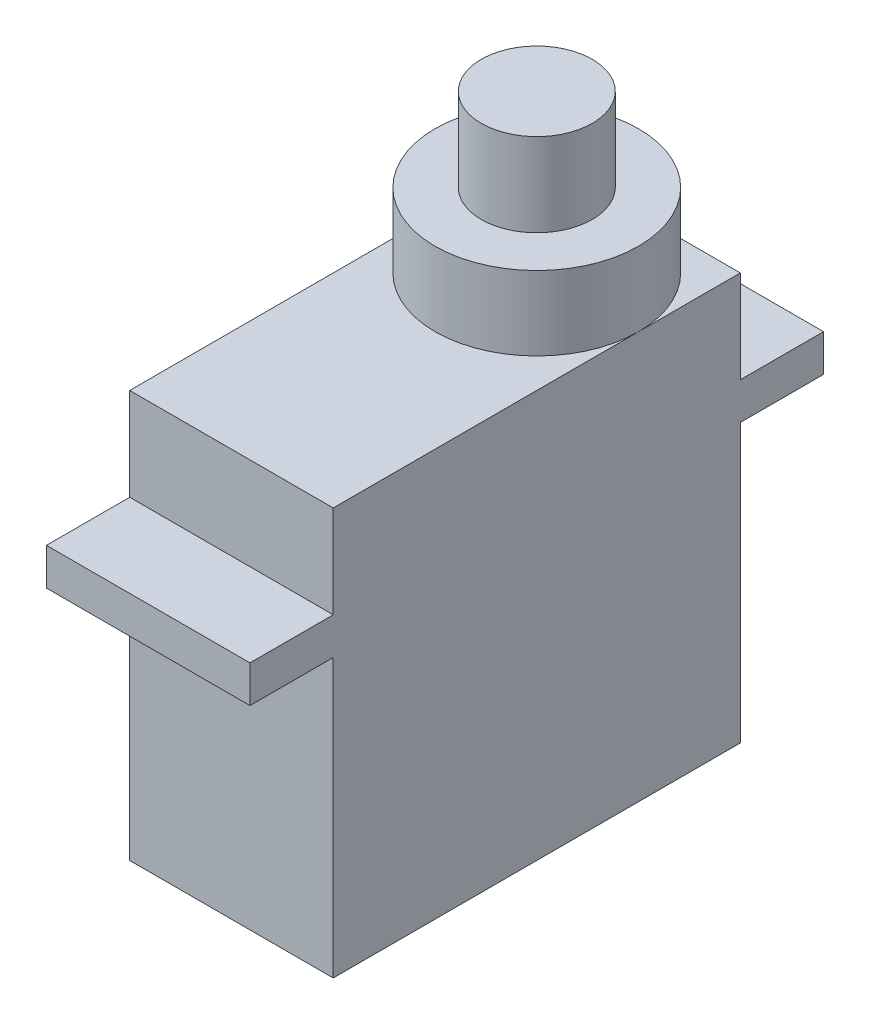
ISO-10303-21;
HEADER;
FILE_DESCRIPTION(('STEP AP214'),'2;1');
FILE_NAME('part.step','',(''),(''),'','','');
FILE_SCHEMA(('AUTOMOTIVE_DESIGN { 1 0 10303 214 1 1 1 1 }'));
ENDSEC;
DATA;
#1=APPLICATION_CONTEXT('core data for automotive mechanical design processes');
#2=APPLICATION_PROTOCOL_DEFINITION('international standard','automotive_design',2000,#1);
#3=PRODUCT_CONTEXT('',#1,'mechanical');
#4=PRODUCT('Part','Part','',(#3));
#5=PRODUCT_RELATED_PRODUCT_CATEGORY('part','',(#4));
#6=PRODUCT_DEFINITION_FORMATION('','',#4);
#7=PRODUCT_DEFINITION_CONTEXT('part definition',#1,'design');
#8=PRODUCT_DEFINITION('design','',#6,#7);
#9=PRODUCT_DEFINITION_SHAPE('','',#8);
#10=(LENGTH_UNIT() NAMED_UNIT(*) SI_UNIT(.MILLI.,.METRE.));
#11=(NAMED_UNIT(*) PLANE_ANGLE_UNIT() SI_UNIT($,.RADIAN.));
#12=(NAMED_UNIT(*) SI_UNIT($,.STERADIAN.) SOLID_ANGLE_UNIT());
#13=UNCERTAINTY_MEASURE_WITH_UNIT(LENGTH_MEASURE(1.E-05),#10,'distance_accuracy_value','');
#14=(GEOMETRIC_REPRESENTATION_CONTEXT(3) GLOBAL_UNCERTAINTY_ASSIGNED_CONTEXT((#13)) GLOBAL_UNIT_ASSIGNED_CONTEXT((#10,
#11,#12)) REPRESENTATION_CONTEXT('',''));
#15=CARTESIAN_POINT('',(0.,0.,0.));
#16=DIRECTION('',(0.,0.,1.));
#17=DIRECTION('',(1.,0.,0.));
#18=AXIS2_PLACEMENT_3D('',#15,#16,#17);
#19=CARTESIAN_POINT('',(0.,22.,0.));
#20=DIRECTION('',(0.,-1.,0.));
#21=DIRECTION('',(0.,0.,-1.));
#22=AXIS2_PLACEMENT_3D('',#19,#20,#21);
#23=PLANE('',#22);
#24=CARTESIAN_POINT('',(0.,22.,-5.5));
#25=DIRECTION('',(0.,1.,0.));
#26=DIRECTION('',(0.,0.,1.));
#27=AXIS2_PLACEMENT_3D('',#24,#25,#26);
#28=CIRCLE('',#27,5.5);
#29=CARTESIAN_POINT('',(5.5,22.,-5.5));
#30=VERTEX_POINT('',#29);
#31=CARTESIAN_POINT('',(0.,22.,-11.));
#32=VERTEX_POINT('',#31);
#33=EDGE_CURVE('E166',#30,#32,#28,.T.);
#34=ORIENTED_EDGE('',*,*,#33,.F.);
#35=DIRECTION('',(0.,0.,-1.));
#36=VECTOR('',#35,1.);
#37=CARTESIAN_POINT('',(5.5,22.,11.));
#38=LINE('',#37,#36);
#39=CARTESIAN_POINT('',(5.5,22.,-11.));
#40=VERTEX_POINT('',#39);
#41=EDGE_CURVE('E154',#30,#40,#38,.T.);
#42=ORIENTED_EDGE('',*,*,#41,.T.);
#43=DIRECTION('',(-1.,0.,0.));
#44=VECTOR('',#43,1.);
#45=CARTESIAN_POINT('',(-5.5,22.,-11.));
#46=LINE('',#45,#44);
#47=EDGE_CURVE('E167',#40,#32,#46,.T.);
#48=ORIENTED_EDGE('',*,*,#47,.T.);
#49=EDGE_LOOP('',(#34,#42,#48));
#50=FACE_BOUND('',#49,.T.);
#51=ADVANCED_FACE('F45',(#50),#23,.F.);
#52=CARTESIAN_POINT('',(-5.5,22.,-5.5));
#53=VERTEX_POINT('',#52);
#54=EDGE_CURVE('E55',#32,#53,#28,.T.);
#55=ORIENTED_EDGE('',*,*,#54,.F.);
#56=CARTESIAN_POINT('',(-5.5,22.,-11.));
#57=VERTEX_POINT('',#56);
#58=EDGE_CURVE('E153',#32,#57,#46,.T.);
#59=ORIENTED_EDGE('',*,*,#58,.T.);
#60=DIRECTION('',(0.,0.,1.));
#61=VECTOR('',#60,1.);
#62=CARTESIAN_POINT('',(-5.5,22.,11.));
#63=LINE('',#62,#61);
#64=EDGE_CURVE('E254',#57,#53,#63,.T.);
#65=ORIENTED_EDGE('',*,*,#64,.T.);
#66=EDGE_LOOP('',(#55,#59,#65));
#67=FACE_BOUND('',#66,.T.);
#68=ADVANCED_FACE('F343',(#67),#23,.F.);
#69=CARTESIAN_POINT('',(-5.5,22.,-11.));
#70=DIRECTION('',(0.,0.,1.));
#71=DIRECTION('',(1.,0.,0.));
#72=AXIS2_PLACEMENT_3D('',#69,#70,#71);
#73=PLANE('',#72);
#74=DIRECTION('',(1.,0.,0.));
#75=VECTOR('',#74,1.);
#76=CARTESIAN_POINT('',(-5.5,17.,-11.));
#77=LINE('',#76,#75);
#78=CARTESIAN_POINT('',(-5.5,17.,-11.));
#79=VERTEX_POINT('',#78);
#80=CARTESIAN_POINT('',(5.5,17.,-11.));
#81=VERTEX_POINT('',#80);
#82=EDGE_CURVE('E180',#79,#81,#77,.T.);
#83=ORIENTED_EDGE('',*,*,#82,.F.);
#84=DIRECTION('',(0.,-1.,0.));
#85=VECTOR('',#84,1.);
#86=CARTESIAN_POINT('',(-5.5,22.,-11.));
#87=LINE('',#86,#85);
#88=EDGE_CURVE('E280',#57,#79,#87,.T.);
#89=ORIENTED_EDGE('',*,*,#88,.F.);
#90=ORIENTED_EDGE('',*,*,#58,.F.);
#91=ORIENTED_EDGE('',*,*,#47,.F.);
#92=DIRECTION('',(0.,-1.,0.));
#93=VECTOR('',#92,1.);
#94=CARTESIAN_POINT('',(5.5,22.,-11.));
#95=LINE('',#94,#93);
#96=EDGE_CURVE('E49',#40,#81,#95,.T.);
#97=ORIENTED_EDGE('',*,*,#96,.T.);
#98=EDGE_LOOP('',(#83,#89,#90,#91,#97));
#99=FACE_BOUND('',#98,.T.);
#100=ADVANCED_FACE('F348',(#99),#73,.F.);
#101=CARTESIAN_POINT('',(-5.5,22.,11.));
#102=DIRECTION('',(0.,0.,-1.));
#103=DIRECTION('',(-1.,0.,0.));
#104=AXIS2_PLACEMENT_3D('',#101,#102,#103);
#105=PLANE('',#104);
#106=DIRECTION('',(-1.,0.,0.));
#107=VECTOR('',#106,1.);
#108=CARTESIAN_POINT('',(-5.5,17.,11.));
#109=LINE('',#108,#107);
#110=CARTESIAN_POINT('',(5.5,17.,11.));
#111=VERTEX_POINT('',#110);
#112=CARTESIAN_POINT('',(-5.5,17.,11.));
#113=VERTEX_POINT('',#112);
#114=EDGE_CURVE('E231',#111,#113,#109,.T.);
#115=ORIENTED_EDGE('',*,*,#114,.F.);
#116=DIRECTION('',(0.,-1.,0.));
#117=VECTOR('',#116,1.);
#118=CARTESIAN_POINT('',(5.5,22.,11.));
#119=LINE('',#118,#117);
#120=CARTESIAN_POINT('',(5.5,22.,11.));
#121=VERTEX_POINT('',#120);
#122=EDGE_CURVE('E273',#121,#111,#119,.T.);
#123=ORIENTED_EDGE('',*,*,#122,.F.);
#124=DIRECTION('',(1.,0.,0.));
#125=VECTOR('',#124,1.);
#126=CARTESIAN_POINT('',(-5.5,22.,11.));
#127=LINE('',#126,#125);
#128=CARTESIAN_POINT('',(-5.5,22.,11.));
#129=VERTEX_POINT('',#128);
#130=EDGE_CURVE('E148',#129,#121,#127,.T.);
#131=ORIENTED_EDGE('',*,*,#130,.F.);
#132=DIRECTION('',(0.,-1.,0.));
#133=VECTOR('',#132,1.);
#134=CARTESIAN_POINT('',(-5.5,22.,11.));
#135=LINE('',#134,#133);
#136=EDGE_CURVE('E277',#129,#113,#135,.T.);
#137=ORIENTED_EDGE('',*,*,#136,.T.);
#138=EDGE_LOOP('',(#115,#123,#131,#137));
#139=FACE_BOUND('',#138,.T.);
#140=ADVANCED_FACE('F358',(#139),#105,.F.);
#141=CARTESIAN_POINT('',(5.5,22.,11.));
#142=DIRECTION('',(-1.,0.,0.));
#143=DIRECTION('',(0.,0.,1.));
#144=AXIS2_PLACEMENT_3D('',#141,#142,#143);
#145=PLANE('',#144);
#146=DIRECTION('',(0.,0.,-1.));
#147=VECTOR('',#146,1.);
#148=CARTESIAN_POINT('',(5.5,0.,11.));
#149=LINE('',#148,#147);
#150=CARTESIAN_POINT('',(5.5,0.,11.));
#151=VERTEX_POINT('',#150);
#152=CARTESIAN_POINT('',(5.5,0.,-11.));
#153=VERTEX_POINT('',#152);
#154=EDGE_CURVE('E216',#151,#153,#149,.T.);
#155=ORIENTED_EDGE('',*,*,#154,.T.);
#156=CARTESIAN_POINT('',(5.5,15.,-11.));
#157=VERTEX_POINT('',#156);
#158=EDGE_CURVE('E177',#157,#153,#95,.T.);
#159=ORIENTED_EDGE('',*,*,#158,.F.);
#160=DIRECTION('',(0.,0.,-1.));
#161=VECTOR('',#160,1.);
#162=CARTESIAN_POINT('',(5.5,15.,-15.5));
#163=LINE('',#162,#161);
#164=CARTESIAN_POINT('',(5.5,15.,-15.5));
#165=VERTEX_POINT('',#164);
#166=EDGE_CURVE('E199',#157,#165,#163,.T.);
#167=ORIENTED_EDGE('',*,*,#166,.T.);
#168=DIRECTION('',(0.,-1.,0.));
#169=VECTOR('',#168,1.);
#170=CARTESIAN_POINT('',(5.5,17.,-15.5));
#171=LINE('',#170,#169);
#172=CARTESIAN_POINT('',(5.5,17.,-15.5));
#173=VERTEX_POINT('',#172);
#174=EDGE_CURVE('E212',#173,#165,#171,.T.);
#175=ORIENTED_EDGE('',*,*,#174,.F.);
#176=DIRECTION('',(0.,0.,-1.));
#177=VECTOR('',#176,1.);
#178=CARTESIAN_POINT('',(5.5,17.,-15.5));
#179=LINE('',#178,#177);
#180=EDGE_CURVE('E184',#81,#173,#179,.T.);
#181=ORIENTED_EDGE('',*,*,#180,.F.);
#182=ORIENTED_EDGE('',*,*,#96,.F.);
#183=ORIENTED_EDGE('',*,*,#41,.F.);
#184=EDGE_CURVE('E144',#121,#30,#38,.T.);
#185=ORIENTED_EDGE('',*,*,#184,.F.);
#186=ORIENTED_EDGE('',*,*,#122,.T.);
#187=DIRECTION('',(0.,0.,-1.));
#188=VECTOR('',#187,1.);
#189=CARTESIAN_POINT('',(5.5,17.,15.5));
#190=LINE('',#189,#188);
#191=CARTESIAN_POINT('',(5.5,17.,15.5));
#192=VERTEX_POINT('',#191);
#193=EDGE_CURVE('E225',#192,#111,#190,.T.);
#194=ORIENTED_EDGE('',*,*,#193,.F.);
#195=DIRECTION('',(0.,-1.,0.));
#196=VECTOR('',#195,1.);
#197=CARTESIAN_POINT('',(5.5,17.,15.5));
#198=LINE('',#197,#196);
#199=CARTESIAN_POINT('',(5.5,15.,15.5));
#200=VERTEX_POINT('',#199);
#201=EDGE_CURVE('E221',#192,#200,#198,.T.);
#202=ORIENTED_EDGE('',*,*,#201,.T.);
#203=DIRECTION('',(0.,0.,-1.));
#204=VECTOR('',#203,1.);
#205=CARTESIAN_POINT('',(5.5,15.,15.5));
#206=LINE('',#205,#204);
#207=CARTESIAN_POINT('',(5.5,15.,11.));
#208=VERTEX_POINT('',#207);
#209=EDGE_CURVE('E226',#200,#208,#206,.T.);
#210=ORIENTED_EDGE('',*,*,#209,.T.);
#211=EDGE_CURVE('E259',#208,#151,#119,.T.);
#212=ORIENTED_EDGE('',*,*,#211,.T.);
#213=EDGE_LOOP('',(#155,#159,#167,#175,#181,#182,#183,#185,#186,#194,#202,#210,#212));
#214=FACE_BOUND('',#213,.T.);
#215=ADVANCED_FACE('F47',(#214),#145,.F.);
#216=CARTESIAN_POINT('',(-5.5,15.,-11.));
#217=VERTEX_POINT('',#216);
#218=CARTESIAN_POINT('',(-5.5,0.,-11.));
#219=VERTEX_POINT('',#218);
#220=EDGE_CURVE('E279',#217,#219,#87,.T.);
#221=ORIENTED_EDGE('',*,*,#220,.F.);
#222=DIRECTION('',(1.,0.,0.));
#223=VECTOR('',#222,1.);
#224=CARTESIAN_POINT('',(-5.5,15.,-11.));
#225=LINE('',#224,#223);
#226=EDGE_CURVE('E196',#217,#157,#225,.T.);
#227=ORIENTED_EDGE('',*,*,#226,.T.);
#228=ORIENTED_EDGE('',*,*,#158,.T.);
#229=DIRECTION('',(-1.,0.,0.));
#230=VECTOR('',#229,1.);
#231=CARTESIAN_POINT('',(-5.5,0.,-11.));
#232=LINE('',#231,#230);
#233=EDGE_CURVE('E262',#153,#219,#232,.T.);
#234=ORIENTED_EDGE('',*,*,#233,.T.);
#235=EDGE_LOOP('',(#221,#227,#228,#234));
#236=FACE_BOUND('',#235,.T.);
#237=ADVANCED_FACE('F297',(#236),#73,.F.);
#238=CARTESIAN_POINT('',(-5.5,22.,11.));
#239=DIRECTION('',(1.,0.,0.));
#240=DIRECTION('',(0.,0.,-1.));
#241=AXIS2_PLACEMENT_3D('',#238,#239,#240);
#242=PLANE('',#241);
#243=DIRECTION('',(0.,0.,1.));
#244=VECTOR('',#243,1.);
#245=CARTESIAN_POINT('',(-5.5,0.,11.));
#246=LINE('',#245,#244);
#247=CARTESIAN_POINT('',(-5.5,0.,11.));
#248=VERTEX_POINT('',#247);
#249=EDGE_CURVE('E266',#219,#248,#246,.T.);
#250=ORIENTED_EDGE('',*,*,#249,.T.);
#251=CARTESIAN_POINT('',(-5.5,15.,11.));
#252=VERTEX_POINT('',#251);
#253=EDGE_CURVE('E276',#252,#248,#135,.T.);
#254=ORIENTED_EDGE('',*,*,#253,.F.);
#255=DIRECTION('',(0.,0.,1.));
#256=VECTOR('',#255,1.);
#257=CARTESIAN_POINT('',(-5.5,15.,11.));
#258=LINE('',#257,#256);
#259=CARTESIAN_POINT('',(-5.5,15.,15.5));
#260=VERTEX_POINT('',#259);
#261=EDGE_CURVE('E234',#252,#260,#258,.T.);
#262=ORIENTED_EDGE('',*,*,#261,.T.);
#263=DIRECTION('',(0.,-1.,0.));
#264=VECTOR('',#263,1.);
#265=CARTESIAN_POINT('',(-5.5,17.,15.5));
#266=LINE('',#265,#264);
#267=CARTESIAN_POINT('',(-5.5,17.,15.5));
#268=VERTEX_POINT('',#267);
#269=EDGE_CURVE('E217',#268,#260,#266,.T.);
#270=ORIENTED_EDGE('',*,*,#269,.F.);
#271=DIRECTION('',(0.,0.,1.));
#272=VECTOR('',#271,1.);
#273=CARTESIAN_POINT('',(-5.5,17.,11.));
#274=LINE('',#273,#272);
#275=EDGE_CURVE('E245',#113,#268,#274,.T.);
#276=ORIENTED_EDGE('',*,*,#275,.F.);
#277=ORIENTED_EDGE('',*,*,#136,.F.);
#278=EDGE_CURVE('E253',#53,#129,#63,.T.);
#279=ORIENTED_EDGE('',*,*,#278,.F.);
#280=ORIENTED_EDGE('',*,*,#64,.F.);
#281=ORIENTED_EDGE('',*,*,#88,.T.);
#282=DIRECTION('',(0.,0.,1.));
#283=VECTOR('',#282,1.);
#284=CARTESIAN_POINT('',(-5.5,17.,-11.));
#285=LINE('',#284,#283);
#286=CARTESIAN_POINT('',(-5.5,17.,-15.5));
#287=VERTEX_POINT('',#286);
#288=EDGE_CURVE('E191',#287,#79,#285,.T.);
#289=ORIENTED_EDGE('',*,*,#288,.F.);
#290=DIRECTION('',(0.,-1.,0.));
#291=VECTOR('',#290,1.);
#292=CARTESIAN_POINT('',(-5.5,17.,-15.5));
#293=LINE('',#292,#291);
#294=CARTESIAN_POINT('',(-5.5,15.,-15.5));
#295=VERTEX_POINT('',#294);
#296=EDGE_CURVE('E195',#287,#295,#293,.T.);
#297=ORIENTED_EDGE('',*,*,#296,.T.);
#298=DIRECTION('',(0.,0.,1.));
#299=VECTOR('',#298,1.);
#300=CARTESIAN_POINT('',(-5.5,15.,-11.));
#301=LINE('',#300,#299);
#302=EDGE_CURVE('E185',#295,#217,#301,.T.);
#303=ORIENTED_EDGE('',*,*,#302,.T.);
#304=ORIENTED_EDGE('',*,*,#220,.T.);
#305=EDGE_LOOP('',(#250,#254,#262,#270,#276,#277,#279,#280,#281,#289,#297,#303,#304));
#306=FACE_BOUND('',#305,.T.);
#307=ADVANCED_FACE('F289',(#306),#242,.F.);
#308=ORIENTED_EDGE('',*,*,#211,.F.);
#309=DIRECTION('',(-1.,0.,0.));
#310=VECTOR('',#309,1.);
#311=CARTESIAN_POINT('',(-5.5,15.,11.));
#312=LINE('',#311,#310);
#313=EDGE_CURVE('E200',#208,#252,#312,.T.);
#314=ORIENTED_EDGE('',*,*,#313,.T.);
#315=ORIENTED_EDGE('',*,*,#253,.T.);
#316=DIRECTION('',(1.,0.,0.));
#317=VECTOR('',#316,1.);
#318=CARTESIAN_POINT('',(-5.5,0.,11.));
#319=LINE('',#318,#317);
#320=EDGE_CURVE('E164',#248,#151,#319,.T.);
#321=ORIENTED_EDGE('',*,*,#320,.T.);
#322=EDGE_LOOP('',(#308,#314,#315,#321));
#323=FACE_BOUND('',#322,.T.);
#324=ADVANCED_FACE('F303',(#323),#105,.F.);
#325=EDGE_CURVE('E63',#53,#30,#28,.T.);
#326=ORIENTED_EDGE('',*,*,#325,.F.);
#327=ORIENTED_EDGE('',*,*,#278,.T.);
#328=ORIENTED_EDGE('',*,*,#130,.T.);
#329=ORIENTED_EDGE('',*,*,#184,.T.);
#330=EDGE_LOOP('',(#326,#327,#328,#329));
#331=FACE_BOUND('',#330,.T.);
#332=ADVANCED_FACE('F146',(#331),#23,.F.);
#333=CARTESIAN_POINT('',(0.,0.,0.));
#334=DIRECTION('',(0.,-1.,0.));
#335=DIRECTION('',(0.,0.,-1.));
#336=AXIS2_PLACEMENT_3D('',#333,#334,#335);
#337=PLANE('',#336);
#338=ORIENTED_EDGE('',*,*,#154,.F.);
#339=ORIENTED_EDGE('',*,*,#320,.F.);
#340=ORIENTED_EDGE('',*,*,#249,.F.);
#341=ORIENTED_EDGE('',*,*,#233,.F.);
#342=EDGE_LOOP('',(#338,#339,#340,#341));
#343=FACE_BOUND('',#342,.T.);
#344=ADVANCED_FACE('F301',(#343),#337,.T.);
#345=CARTESIAN_POINT('',(-5.5,17.,15.5));
#346=DIRECTION('',(0.,0.,-1.));
#347=DIRECTION('',(-1.,0.,0.));
#348=AXIS2_PLACEMENT_3D('',#345,#346,#347);
#349=PLANE('',#348);
#350=DIRECTION('',(1.,0.,0.));
#351=VECTOR('',#350,1.);
#352=CARTESIAN_POINT('',(-5.5,15.,15.5));
#353=LINE('',#352,#351);
#354=EDGE_CURVE('E230',#260,#200,#353,.T.);
#355=ORIENTED_EDGE('',*,*,#354,.T.);
#356=ORIENTED_EDGE('',*,*,#201,.F.);
#357=DIRECTION('',(1.,0.,0.));
#358=VECTOR('',#357,1.);
#359=CARTESIAN_POINT('',(-5.5,17.,15.5));
#360=LINE('',#359,#358);
#361=EDGE_CURVE('E242',#268,#192,#360,.T.);
#362=ORIENTED_EDGE('',*,*,#361,.F.);
#363=ORIENTED_EDGE('',*,*,#269,.T.);
#364=EDGE_LOOP('',(#355,#356,#362,#363));
#365=FACE_BOUND('',#364,.T.);
#366=ADVANCED_FACE('F355',(#365),#349,.F.);
#367=CARTESIAN_POINT('',(0.,17.,0.));
#368=DIRECTION('',(0.,1.,0.));
#369=DIRECTION('',(0.,0.,1.));
#370=AXIS2_PLACEMENT_3D('',#367,#368,#369);
#371=PLANE('',#370);
#372=ORIENTED_EDGE('',*,*,#114,.T.);
#373=ORIENTED_EDGE('',*,*,#275,.T.);
#374=ORIENTED_EDGE('',*,*,#361,.T.);
#375=ORIENTED_EDGE('',*,*,#193,.T.);
#376=EDGE_LOOP('',(#372,#373,#374,#375));
#377=FACE_BOUND('',#376,.T.);
#378=ADVANCED_FACE('F375',(#377),#371,.T.);
#379=CARTESIAN_POINT('',(0.,15.,0.));
#380=DIRECTION('',(0.,1.,0.));
#381=DIRECTION('',(0.,0.,1.));
#382=AXIS2_PLACEMENT_3D('',#379,#380,#381);
#383=PLANE('',#382);
#384=ORIENTED_EDGE('',*,*,#313,.F.);
#385=ORIENTED_EDGE('',*,*,#209,.F.);
#386=ORIENTED_EDGE('',*,*,#354,.F.);
#387=ORIENTED_EDGE('',*,*,#261,.F.);
#388=EDGE_LOOP('',(#384,#385,#386,#387));
#389=FACE_BOUND('',#388,.T.);
#390=ADVANCED_FACE('F383',(#389),#383,.F.);
#391=CARTESIAN_POINT('',(-5.5,17.,-15.5));
#392=DIRECTION('',(0.,0.,1.));
#393=DIRECTION('',(1.,0.,0.));
#394=AXIS2_PLACEMENT_3D('',#391,#392,#393);
#395=PLANE('',#394);
#396=DIRECTION('',(-1.,0.,0.));
#397=VECTOR('',#396,1.);
#398=CARTESIAN_POINT('',(-5.5,15.,-15.5));
#399=LINE('',#398,#397);
#400=EDGE_CURVE('E203',#165,#295,#399,.T.);
#401=ORIENTED_EDGE('',*,*,#400,.T.);
#402=ORIENTED_EDGE('',*,*,#296,.F.);
#403=DIRECTION('',(-1.,0.,0.));
#404=VECTOR('',#403,1.);
#405=CARTESIAN_POINT('',(-5.5,17.,-15.5));
#406=LINE('',#405,#404);
#407=EDGE_CURVE('E188',#173,#287,#406,.T.);
#408=ORIENTED_EDGE('',*,*,#407,.F.);
#409=ORIENTED_EDGE('',*,*,#174,.T.);
#410=EDGE_LOOP('',(#401,#402,#408,#409));
#411=FACE_BOUND('',#410,.T.);
#412=ADVANCED_FACE('F391',(#411),#395,.F.);
#413=CARTESIAN_POINT('',(0.,17.,0.));
#414=DIRECTION('',(0.,-1.,0.));
#415=DIRECTION('',(0.,0.,-1.));
#416=AXIS2_PLACEMENT_3D('',#413,#414,#415);
#417=PLANE('',#416);
#418=ORIENTED_EDGE('',*,*,#82,.T.);
#419=ORIENTED_EDGE('',*,*,#180,.T.);
#420=ORIENTED_EDGE('',*,*,#407,.T.);
#421=ORIENTED_EDGE('',*,*,#288,.T.);
#422=EDGE_LOOP('',(#418,#419,#420,#421));
#423=FACE_BOUND('',#422,.T.);
#424=ADVANCED_FACE('F338',(#423),#417,.F.);
#425=CARTESIAN_POINT('',(0.,15.,0.));
#426=DIRECTION('',(0.,-1.,0.));
#427=DIRECTION('',(0.,0.,-1.));
#428=AXIS2_PLACEMENT_3D('',#425,#426,#427);
#429=PLANE('',#428);
#430=ORIENTED_EDGE('',*,*,#226,.F.);
#431=ORIENTED_EDGE('',*,*,#302,.F.);
#432=ORIENTED_EDGE('',*,*,#400,.F.);
#433=ORIENTED_EDGE('',*,*,#166,.F.);
#434=EDGE_LOOP('',(#430,#431,#432,#433));
#435=FACE_BOUND('',#434,.T.);
#436=ADVANCED_FACE('F332',(#435),#429,.T.);
#437=CARTESIAN_POINT('',(0.,26.,-5.5));
#438=DIRECTION('',(0.,-1.,0.));
#439=DIRECTION('',(0.,0.,-1.));
#440=AXIS2_PLACEMENT_3D('',#437,#438,#439);
#441=CYLINDRICAL_SURFACE('',#440,5.5);
#442=CARTESIAN_POINT('',(0.,26.,-5.5));
#443=DIRECTION('',(0.,1.,0.));
#444=DIRECTION('',(0.,0.,1.));
#445=AXIS2_PLACEMENT_3D('',#442,#443,#444);
#446=CIRCLE('',#445,5.5);
#447=CARTESIAN_POINT('',(0.,26.,0.));
#448=VERTEX_POINT('',#447);
#449=EDGE_CURVE('E170',#448,#448,#446,.T.);
#450=ORIENTED_EDGE('',*,*,#449,.F.);
#451=EDGE_LOOP('',(#450));
#452=FACE_BOUND('',#451,.T.);
#453=ORIENTED_EDGE('',*,*,#33,.T.);
#454=ORIENTED_EDGE('',*,*,#54,.T.);
#455=ORIENTED_EDGE('',*,*,#325,.T.);
#456=EDGE_LOOP('',(#453,#454,#455));
#457=FACE_BOUND('',#456,.T.);
#458=ADVANCED_FACE('F173',(#452,#457),#441,.T.);
#459=CARTESIAN_POINT('',(0.,26.,-5.5));
#460=DIRECTION('',(0.,1.,0.));
#461=DIRECTION('',(0.,0.,1.));
#462=AXIS2_PLACEMENT_3D('',#459,#460,#461);
#463=PLANE('',#462);
#464=CARTESIAN_POINT('',(0.,26.,-5.5));
#465=DIRECTION('',(0.,1.,0.));
#466=DIRECTION('',(0.,0.,1.));
#467=AXIS2_PLACEMENT_3D('',#464,#465,#466);
#468=CIRCLE('',#467,3.);
#469=CARTESIAN_POINT('',(0.,26.,-2.5));
#470=VERTEX_POINT('',#469);
#471=EDGE_CURVE('E11',#470,#470,#468,.T.);
#472=ORIENTED_EDGE('',*,*,#471,.F.);
#473=EDGE_LOOP('',(#472));
#474=FACE_BOUND('',#473,.T.);
#475=ORIENTED_EDGE('',*,*,#449,.T.);
#476=EDGE_LOOP('',(#475));
#477=FACE_BOUND('',#476,.T.);
#478=ADVANCED_FACE('F322',(#474,#477),#463,.T.);
#479=CARTESIAN_POINT('',(0.,30.5,-5.5));
#480=DIRECTION('',(0.,-1.,0.));
#481=DIRECTION('',(0.,0.,-1.));
#482=AXIS2_PLACEMENT_3D('',#479,#480,#481);
#483=CYLINDRICAL_SURFACE('',#482,3.);
#484=CARTESIAN_POINT('',(0.,30.5,-5.5));
#485=DIRECTION('',(0.,1.,0.));
#486=DIRECTION('',(0.,0.,1.));
#487=AXIS2_PLACEMENT_3D('',#484,#485,#486);
#488=CIRCLE('',#487,3.);
#489=CARTESIAN_POINT('',(0.,30.5,-2.5));
#490=VERTEX_POINT('',#489);
#491=EDGE_CURVE('E171',#490,#490,#488,.T.);
#492=ORIENTED_EDGE('',*,*,#491,.F.);
#493=EDGE_LOOP('',(#492));
#494=FACE_BOUND('',#493,.T.);
#495=ORIENTED_EDGE('',*,*,#471,.T.);
#496=EDGE_LOOP('',(#495));
#497=FACE_BOUND('',#496,.T.);
#498=ADVANCED_FACE('F319',(#494,#497),#483,.T.);
#499=CARTESIAN_POINT('',(0.,30.5,-5.5));
#500=DIRECTION('',(0.,1.,0.));
#501=DIRECTION('',(0.,0.,1.));
#502=AXIS2_PLACEMENT_3D('',#499,#500,#501);
#503=PLANE('',#502);
#504=ORIENTED_EDGE('',*,*,#491,.T.);
#505=EDGE_LOOP('',(#504));
#506=FACE_BOUND('',#505,.T.);
#507=ADVANCED_FACE('F317',(#506),#503,.T.);
#508=CLOSED_SHELL('',(#51,#68,#100,#140,#215,#237,#307,#324,#332,#344,#366,#378,#390,#412,#424,
#436,#458,#478,#498,#507));
#509=MANIFOLD_SOLID_BREP('B2',#508);
#510=ADVANCED_BREP_SHAPE_REPRESENTATION('',(#18,#509),#14);
#511=SHAPE_DEFINITION_REPRESENTATION(#9,#510);
ENDSEC;
END-ISO-10303-21;
